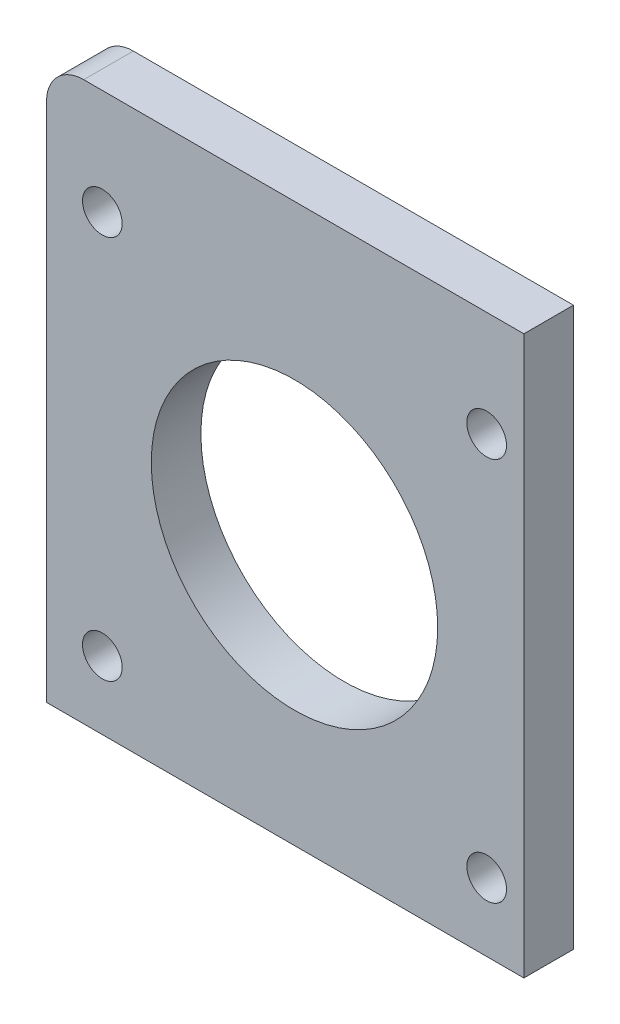
ISO-10303-21;
HEADER;
FILE_DESCRIPTION(('STEP AP214'),'2;1');
FILE_NAME('part.step','',(''),(''),'','','');
FILE_SCHEMA(('AUTOMOTIVE_DESIGN { 1 0 10303 214 1 1 1 1 }'));
ENDSEC;
DATA;
#1=APPLICATION_CONTEXT('core data for automotive mechanical design processes');
#2=APPLICATION_PROTOCOL_DEFINITION('international standard','automotive_design',2000,#1);
#3=PRODUCT_CONTEXT('',#1,'mechanical');
#4=PRODUCT('Part','Part','',(#3));
#5=PRODUCT_RELATED_PRODUCT_CATEGORY('part','',(#4));
#6=PRODUCT_DEFINITION_FORMATION('','',#4);
#7=PRODUCT_DEFINITION_CONTEXT('part definition',#1,'design');
#8=PRODUCT_DEFINITION('design','',#6,#7);
#9=PRODUCT_DEFINITION_SHAPE('','',#8);
#10=(LENGTH_UNIT() NAMED_UNIT(*) SI_UNIT(.MILLI.,.METRE.));
#11=(NAMED_UNIT(*) PLANE_ANGLE_UNIT() SI_UNIT($,.RADIAN.));
#12=(NAMED_UNIT(*) SI_UNIT($,.STERADIAN.) SOLID_ANGLE_UNIT());
#13=UNCERTAINTY_MEASURE_WITH_UNIT(LENGTH_MEASURE(1.E-05),#10,'distance_accuracy_value','');
#14=(GEOMETRIC_REPRESENTATION_CONTEXT(3) GLOBAL_UNCERTAINTY_ASSIGNED_CONTEXT((#13)) GLOBAL_UNIT_ASSIGNED_CONTEXT((#10,
#11,#12)) REPRESENTATION_CONTEXT('',''));
#15=CARTESIAN_POINT('',(0.,0.,0.));
#16=DIRECTION('',(0.,0.,1.));
#17=DIRECTION('',(1.,0.,0.));
#18=AXIS2_PLACEMENT_3D('',#15,#16,#17);
#19=CARTESIAN_POINT('',(27.0710686986759,-58.5949088292678,4.));
#20=DIRECTION('',(0.,0.,1.));
#21=DIRECTION('',(1.,0.,0.));
#22=AXIS2_PLACEMENT_3D('',#19,#20,#21);
#23=PLANE('',#22);
#24=CARTESIAN_POINT('',(44.0710686986754,-79.5949088292686,4.));
#25=DIRECTION('',(0.,0.,1.));
#26=DIRECTION('',(1.,0.,0.));
#27=AXIS2_PLACEMENT_3D('',#24,#25,#26);
#28=CIRCLE('',#27,11.5502037625455);
#29=CARTESIAN_POINT('',(55.6212724612209,-79.5949088292686,4.));
#30=VERTEX_POINT('',#29);
#31=EDGE_CURVE('E166',#30,#30,#28,.T.);
#32=ORIENTED_EDGE('',*,*,#31,.F.);
#33=EDGE_LOOP('',(#32));
#34=FACE_BOUND('',#33,.T.);
#35=CARTESIAN_POINT('',(28.5710686986753,-95.0949088292685,4.));
#36=DIRECTION('',(0.,0.,1.));
#37=DIRECTION('',(1.,0.,0.));
#38=AXIS2_PLACEMENT_3D('',#35,#36,#37);
#39=CIRCLE('',#38,1.59999999999999);
#40=CARTESIAN_POINT('',(30.1710686986753,-95.0949088292685,4.));
#41=VERTEX_POINT('',#40);
#42=EDGE_CURVE('E180',#41,#41,#39,.T.);
#43=ORIENTED_EDGE('',*,*,#42,.F.);
#44=EDGE_LOOP('',(#43));
#45=FACE_BOUND('',#44,.T.);
#46=CARTESIAN_POINT('',(27.0710686986759,-58.5949088292678,4.));
#47=DIRECTION('',(0.,0.,1.));
#48=DIRECTION('',(1.,0.,0.));
#49=AXIS2_PLACEMENT_3D('',#46,#47,#48);
#50=CIRCLE('',#49,3.);
#51=CARTESIAN_POINT('',(27.0710686986759,-55.5949088292678,4.));
#52=VERTEX_POINT('',#51);
#53=CARTESIAN_POINT('',(24.0710686986759,-58.5949088292677,4.));
#54=VERTEX_POINT('',#53);
#55=EDGE_CURVE('E116',#52,#54,#50,.T.);
#56=ORIENTED_EDGE('',*,*,#55,.T.);
#57=DIRECTION('',(0.,-1.,0.));
#58=VECTOR('',#57,1.);
#59=CARTESIAN_POINT('',(24.0710686986757,-100.594908829268,4.));
#60=LINE('',#59,#58);
#61=CARTESIAN_POINT('',(24.0710686986757,-100.594908829268,4.));
#62=VERTEX_POINT('',#61);
#63=EDGE_CURVE('E83',#54,#62,#60,.T.);
#64=ORIENTED_EDGE('',*,*,#63,.T.);
#65=DIRECTION('',(1.,0.,0.));
#66=VECTOR('',#65,1.);
#67=CARTESIAN_POINT('',(24.0710686986757,-100.594908829268,4.));
#68=LINE('',#67,#66);
#69=CARTESIAN_POINT('',(62.5710686986753,-100.594908829268,4.));
#70=VERTEX_POINT('',#69);
#71=EDGE_CURVE('E87',#62,#70,#68,.T.);
#72=ORIENTED_EDGE('',*,*,#71,.T.);
#73=DIRECTION('',(0.,1.,0.));
#74=VECTOR('',#73,1.);
#75=CARTESIAN_POINT('',(62.5710686986753,-100.594908829268,4.));
#76=LINE('',#75,#74);
#77=CARTESIAN_POINT('',(62.5710686986753,-55.5949088292678,4.));
#78=VERTEX_POINT('',#77);
#79=EDGE_CURVE('E91',#70,#78,#76,.T.);
#80=ORIENTED_EDGE('',*,*,#79,.T.);
#81=DIRECTION('',(-1.,0.,0.));
#82=VECTOR('',#81,1.);
#83=CARTESIAN_POINT('',(27.0710686986759,-55.5949088292678,4.));
#84=LINE('',#83,#82);
#85=EDGE_CURVE('E49',#78,#52,#84,.T.);
#86=ORIENTED_EDGE('',*,*,#85,.T.);
#87=EDGE_LOOP('',(#56,#64,#72,#80,#86));
#88=FACE_BOUND('',#87,.T.);
#89=CARTESIAN_POINT('',(28.5710686986753,-64.0949088292685,4.));
#90=DIRECTION('',(0.,0.,1.));
#91=DIRECTION('',(1.,0.,0.));
#92=AXIS2_PLACEMENT_3D('',#89,#90,#91);
#93=CIRCLE('',#92,1.59999999999999);
#94=CARTESIAN_POINT('',(30.1710686986753,-64.0949088292685,4.));
#95=VERTEX_POINT('',#94);
#96=EDGE_CURVE('E111',#95,#95,#93,.T.);
#97=ORIENTED_EDGE('',*,*,#96,.F.);
#98=EDGE_LOOP('',(#97));
#99=FACE_BOUND('',#98,.T.);
#100=CARTESIAN_POINT('',(59.5710686986753,-64.0949088292685,4.));
#101=DIRECTION('',(0.,0.,1.));
#102=DIRECTION('',(1.,0.,0.));
#103=AXIS2_PLACEMENT_3D('',#100,#101,#102);
#104=CIRCLE('',#103,1.59999999999999);
#105=CARTESIAN_POINT('',(61.1710686986753,-64.0949088292685,4.));
#106=VERTEX_POINT('',#105);
#107=EDGE_CURVE('E186',#106,#106,#104,.T.);
#108=ORIENTED_EDGE('',*,*,#107,.F.);
#109=EDGE_LOOP('',(#108));
#110=FACE_BOUND('',#109,.T.);
#111=CARTESIAN_POINT('',(59.5710686986753,-95.0949088292686,4.));
#112=DIRECTION('',(0.,0.,1.));
#113=DIRECTION('',(1.,0.,0.));
#114=AXIS2_PLACEMENT_3D('',#111,#112,#113);
#115=CIRCLE('',#114,1.59999999999999);
#116=CARTESIAN_POINT('',(61.1710686986753,-95.0949088292686,4.));
#117=VERTEX_POINT('',#116);
#118=EDGE_CURVE('E174',#117,#117,#115,.T.);
#119=ORIENTED_EDGE('',*,*,#118,.F.);
#120=EDGE_LOOP('',(#119));
#121=FACE_BOUND('',#120,.T.);
#122=ADVANCED_FACE('F32',(#34,#45,#88,#99,#110,#121),#23,.T.);
#123=CARTESIAN_POINT('',(27.0710686986759,-58.5949088292678,0.));
#124=DIRECTION('',(0.,0.,1.));
#125=DIRECTION('',(1.,0.,0.));
#126=AXIS2_PLACEMENT_3D('',#123,#124,#125);
#127=PLANE('',#126);
#128=CARTESIAN_POINT('',(44.0710686986754,-79.5949088292686,0.));
#129=DIRECTION('',(0.,0.,-1.));
#130=DIRECTION('',(-1.,0.,0.));
#131=AXIS2_PLACEMENT_3D('',#128,#129,#130);
#132=CIRCLE('',#131,11.5502037625455);
#133=CARTESIAN_POINT('',(32.5208649361299,-79.5949088292686,0.));
#134=VERTEX_POINT('',#133);
#135=EDGE_CURVE('E169',#134,#134,#132,.T.);
#136=ORIENTED_EDGE('',*,*,#135,.F.);
#137=EDGE_LOOP('',(#136));
#138=FACE_BOUND('',#137,.T.);
#139=CARTESIAN_POINT('',(27.0710686986759,-58.5949088292678,0.));
#140=DIRECTION('',(0.,0.,1.));
#141=DIRECTION('',(1.,0.,0.));
#142=AXIS2_PLACEMENT_3D('',#139,#140,#141);
#143=CIRCLE('',#142,3.);
#144=CARTESIAN_POINT('',(27.0710686986759,-55.5949088292678,0.));
#145=VERTEX_POINT('',#144);
#146=CARTESIAN_POINT('',(24.0710686986759,-58.5949088292677,0.));
#147=VERTEX_POINT('',#146);
#148=EDGE_CURVE('E107',#145,#147,#143,.T.);
#149=ORIENTED_EDGE('',*,*,#148,.F.);
#150=DIRECTION('',(-1.,0.,0.));
#151=VECTOR('',#150,1.);
#152=CARTESIAN_POINT('',(27.0710686986759,-55.5949088292678,0.));
#153=LINE('',#152,#151);
#154=CARTESIAN_POINT('',(62.5710686986753,-55.5949088292678,0.));
#155=VERTEX_POINT('',#154);
#156=EDGE_CURVE('E75',#155,#145,#153,.T.);
#157=ORIENTED_EDGE('',*,*,#156,.F.);
#158=DIRECTION('',(0.,1.,0.));
#159=VECTOR('',#158,1.);
#160=CARTESIAN_POINT('',(62.5710686986753,-100.594908829268,0.));
#161=LINE('',#160,#159);
#162=CARTESIAN_POINT('',(62.5710686986753,-100.594908829268,0.));
#163=VERTEX_POINT('',#162);
#164=EDGE_CURVE('E69',#163,#155,#161,.T.);
#165=ORIENTED_EDGE('',*,*,#164,.F.);
#166=DIRECTION('',(1.,0.,0.));
#167=VECTOR('',#166,1.);
#168=CARTESIAN_POINT('',(24.0710686986757,-100.594908829268,0.));
#169=LINE('',#168,#167);
#170=CARTESIAN_POINT('',(24.0710686986757,-100.594908829268,0.));
#171=VERTEX_POINT('',#170);
#172=EDGE_CURVE('E98',#171,#163,#169,.T.);
#173=ORIENTED_EDGE('',*,*,#172,.F.);
#174=DIRECTION('',(0.,-1.,0.));
#175=VECTOR('',#174,1.);
#176=CARTESIAN_POINT('',(24.0710686986757,-100.594908829268,0.));
#177=LINE('',#176,#175);
#178=EDGE_CURVE('E110',#147,#171,#177,.T.);
#179=ORIENTED_EDGE('',*,*,#178,.F.);
#180=EDGE_LOOP('',(#149,#157,#165,#173,#179));
#181=FACE_BOUND('',#180,.T.);
#182=CARTESIAN_POINT('',(28.5710686986753,-64.0949088292685,0.));
#183=DIRECTION('',(0.,0.,1.));
#184=DIRECTION('',(1.,0.,0.));
#185=AXIS2_PLACEMENT_3D('',#182,#183,#184);
#186=CIRCLE('',#185,1.59999999999999);
#187=CARTESIAN_POINT('',(30.1710686986753,-64.0949088292685,0.));
#188=VERTEX_POINT('',#187);
#189=EDGE_CURVE('E189',#188,#188,#186,.T.);
#190=ORIENTED_EDGE('',*,*,#189,.T.);
#191=EDGE_LOOP('',(#190));
#192=FACE_BOUND('',#191,.T.);
#193=CARTESIAN_POINT('',(59.5710686986753,-64.0949088292685,0.));
#194=DIRECTION('',(0.,0.,1.));
#195=DIRECTION('',(1.,0.,0.));
#196=AXIS2_PLACEMENT_3D('',#193,#194,#195);
#197=CIRCLE('',#196,1.59999999999999);
#198=CARTESIAN_POINT('',(61.1710686986753,-64.0949088292685,0.));
#199=VERTEX_POINT('',#198);
#200=EDGE_CURVE('E183',#199,#199,#197,.T.);
#201=ORIENTED_EDGE('',*,*,#200,.T.);
#202=EDGE_LOOP('',(#201));
#203=FACE_BOUND('',#202,.T.);
#204=CARTESIAN_POINT('',(28.5710686986753,-95.0949088292685,0.));
#205=DIRECTION('',(0.,0.,1.));
#206=DIRECTION('',(1.,0.,0.));
#207=AXIS2_PLACEMENT_3D('',#204,#205,#206);
#208=CIRCLE('',#207,1.59999999999999);
#209=CARTESIAN_POINT('',(30.1710686986753,-95.0949088292685,0.));
#210=VERTEX_POINT('',#209);
#211=EDGE_CURVE('E177',#210,#210,#208,.T.);
#212=ORIENTED_EDGE('',*,*,#211,.T.);
#213=EDGE_LOOP('',(#212));
#214=FACE_BOUND('',#213,.T.);
#215=CARTESIAN_POINT('',(59.5710686986753,-95.0949088292686,0.));
#216=DIRECTION('',(0.,0.,1.));
#217=DIRECTION('',(1.,0.,0.));
#218=AXIS2_PLACEMENT_3D('',#215,#216,#217);
#219=CIRCLE('',#218,1.59999999999999);
#220=CARTESIAN_POINT('',(61.1710686986753,-95.0949088292686,0.));
#221=VERTEX_POINT('',#220);
#222=EDGE_CURVE('E171',#221,#221,#219,.T.);
#223=ORIENTED_EDGE('',*,*,#222,.T.);
#224=EDGE_LOOP('',(#223));
#225=FACE_BOUND('',#224,.T.);
#226=ADVANCED_FACE('F120',(#138,#181,#192,#203,#214,#225),#127,.F.);
#227=CARTESIAN_POINT('',(27.0710686986759,-58.5949088292678,4.));
#228=DIRECTION('',(0.,0.,-1.));
#229=DIRECTION('',(-1.,0.,0.));
#230=AXIS2_PLACEMENT_3D('',#227,#228,#229);
#231=CYLINDRICAL_SURFACE('',#230,3.);
#232=ORIENTED_EDGE('',*,*,#148,.T.);
#233=DIRECTION('',(0.,0.,-1.));
#234=VECTOR('',#233,1.);
#235=CARTESIAN_POINT('',(24.0710686986759,-58.5949088292677,4.));
#236=LINE('',#235,#234);
#237=EDGE_CURVE('E11',#54,#147,#236,.T.);
#238=ORIENTED_EDGE('',*,*,#237,.F.);
#239=ORIENTED_EDGE('',*,*,#55,.F.);
#240=DIRECTION('',(0.,0.,-1.));
#241=VECTOR('',#240,1.);
#242=CARTESIAN_POINT('',(27.0710686986759,-55.5949088292678,4.));
#243=LINE('',#242,#241);
#244=EDGE_CURVE('E103',#52,#145,#243,.T.);
#245=ORIENTED_EDGE('',*,*,#244,.T.);
#246=EDGE_LOOP('',(#232,#238,#239,#245));
#247=FACE_BOUND('',#246,.T.);
#248=ADVANCED_FACE('F34',(#247),#231,.T.);
#249=CARTESIAN_POINT('',(24.0710686986757,-100.594908829268,4.));
#250=DIRECTION('',(1.,0.,0.));
#251=DIRECTION('',(0.,1.,0.));
#252=AXIS2_PLACEMENT_3D('',#249,#250,#251);
#253=PLANE('',#252);
#254=ORIENTED_EDGE('',*,*,#178,.T.);
#255=DIRECTION('',(0.,0.,-1.));
#256=VECTOR('',#255,1.);
#257=CARTESIAN_POINT('',(24.0710686986757,-100.594908829268,4.));
#258=LINE('',#257,#256);
#259=EDGE_CURVE('E41',#62,#171,#258,.T.);
#260=ORIENTED_EDGE('',*,*,#259,.F.);
#261=ORIENTED_EDGE('',*,*,#63,.F.);
#262=ORIENTED_EDGE('',*,*,#237,.T.);
#263=EDGE_LOOP('',(#254,#260,#261,#262));
#264=FACE_BOUND('',#263,.T.);
#265=ADVANCED_FACE('F249',(#264),#253,.F.);
#266=CARTESIAN_POINT('',(24.0710686986757,-100.594908829268,4.));
#267=DIRECTION('',(0.,1.,0.));
#268=DIRECTION('',(0.,0.,1.));
#269=AXIS2_PLACEMENT_3D('',#266,#267,#268);
#270=PLANE('',#269);
#271=ORIENTED_EDGE('',*,*,#172,.T.);
#272=DIRECTION('',(0.,0.,-1.));
#273=VECTOR('',#272,1.);
#274=CARTESIAN_POINT('',(62.5710686986753,-100.594908829268,4.));
#275=LINE('',#274,#273);
#276=EDGE_CURVE('E95',#70,#163,#275,.T.);
#277=ORIENTED_EDGE('',*,*,#276,.F.);
#278=ORIENTED_EDGE('',*,*,#71,.F.);
#279=ORIENTED_EDGE('',*,*,#259,.T.);
#280=EDGE_LOOP('',(#271,#277,#278,#279));
#281=FACE_BOUND('',#280,.T.);
#282=ADVANCED_FACE('F96',(#281),#270,.F.);
#283=CARTESIAN_POINT('',(62.5710686986753,-100.594908829268,4.));
#284=DIRECTION('',(-1.,0.,0.));
#285=DIRECTION('',(0.,0.,1.));
#286=AXIS2_PLACEMENT_3D('',#283,#284,#285);
#287=PLANE('',#286);
#288=ORIENTED_EDGE('',*,*,#164,.T.);
#289=DIRECTION('',(0.,0.,-1.));
#290=VECTOR('',#289,1.);
#291=CARTESIAN_POINT('',(62.5710686986753,-55.5949088292678,4.));
#292=LINE('',#291,#290);
#293=EDGE_CURVE('E99',#78,#155,#292,.T.);
#294=ORIENTED_EDGE('',*,*,#293,.F.);
#295=ORIENTED_EDGE('',*,*,#79,.F.);
#296=ORIENTED_EDGE('',*,*,#276,.T.);
#297=EDGE_LOOP('',(#288,#294,#295,#296));
#298=FACE_BOUND('',#297,.T.);
#299=ADVANCED_FACE('F101',(#298),#287,.F.);
#300=CARTESIAN_POINT('',(27.0710686986759,-55.5949088292678,4.));
#301=DIRECTION('',(0.,-1.,0.));
#302=DIRECTION('',(0.,0.,-1.));
#303=AXIS2_PLACEMENT_3D('',#300,#301,#302);
#304=PLANE('',#303);
#305=ORIENTED_EDGE('',*,*,#156,.T.);
#306=ORIENTED_EDGE('',*,*,#244,.F.);
#307=ORIENTED_EDGE('',*,*,#85,.F.);
#308=ORIENTED_EDGE('',*,*,#293,.T.);
#309=EDGE_LOOP('',(#305,#306,#307,#308));
#310=FACE_BOUND('',#309,.T.);
#311=ADVANCED_FACE('F125',(#310),#304,.F.);
#312=CARTESIAN_POINT('',(28.5710686986753,-64.0949088292685,4.));
#313=DIRECTION('',(0.,0.,-1.));
#314=DIRECTION('',(-1.,0.,0.));
#315=AXIS2_PLACEMENT_3D('',#312,#313,#314);
#316=CYLINDRICAL_SURFACE('',#315,1.59999999999999);
#317=ORIENTED_EDGE('',*,*,#96,.T.);
#318=EDGE_LOOP('',(#317));
#319=FACE_BOUND('',#318,.T.);
#320=ORIENTED_EDGE('',*,*,#189,.F.);
#321=EDGE_LOOP('',(#320));
#322=FACE_BOUND('',#321,.T.);
#323=ADVANCED_FACE('F127',(#319,#322),#316,.F.);
#324=CARTESIAN_POINT('',(59.5710686986753,-64.0949088292685,4.));
#325=DIRECTION('',(0.,0.,-1.));
#326=DIRECTION('',(-1.,0.,0.));
#327=AXIS2_PLACEMENT_3D('',#324,#325,#326);
#328=CYLINDRICAL_SURFACE('',#327,1.59999999999999);
#329=ORIENTED_EDGE('',*,*,#107,.T.);
#330=EDGE_LOOP('',(#329));
#331=FACE_BOUND('',#330,.T.);
#332=ORIENTED_EDGE('',*,*,#200,.F.);
#333=EDGE_LOOP('',(#332));
#334=FACE_BOUND('',#333,.T.);
#335=ADVANCED_FACE('F133',(#331,#334),#328,.F.);
#336=CARTESIAN_POINT('',(28.5710686986753,-95.0949088292685,4.));
#337=DIRECTION('',(0.,0.,-1.));
#338=DIRECTION('',(-1.,0.,0.));
#339=AXIS2_PLACEMENT_3D('',#336,#337,#338);
#340=CYLINDRICAL_SURFACE('',#339,1.59999999999999);
#341=ORIENTED_EDGE('',*,*,#42,.T.);
#342=EDGE_LOOP('',(#341));
#343=FACE_BOUND('',#342,.T.);
#344=ORIENTED_EDGE('',*,*,#211,.F.);
#345=EDGE_LOOP('',(#344));
#346=FACE_BOUND('',#345,.T.);
#347=ADVANCED_FACE('F150',(#343,#346),#340,.F.);
#348=CARTESIAN_POINT('',(59.5710686986753,-95.0949088292686,4.));
#349=DIRECTION('',(0.,0.,-1.));
#350=DIRECTION('',(-1.,0.,0.));
#351=AXIS2_PLACEMENT_3D('',#348,#349,#350);
#352=CYLINDRICAL_SURFACE('',#351,1.59999999999999);
#353=ORIENTED_EDGE('',*,*,#118,.T.);
#354=EDGE_LOOP('',(#353));
#355=FACE_BOUND('',#354,.T.);
#356=ORIENTED_EDGE('',*,*,#222,.F.);
#357=EDGE_LOOP('',(#356));
#358=FACE_BOUND('',#357,.T.);
#359=ADVANCED_FACE('F154',(#355,#358),#352,.F.);
#360=CARTESIAN_POINT('',(44.0710686986754,-79.5949088292686,5.));
#361=DIRECTION('',(0.,0.,-1.));
#362=DIRECTION('',(-1.,0.,0.));
#363=AXIS2_PLACEMENT_3D('',#360,#361,#362);
#364=CYLINDRICAL_SURFACE('',#363,11.5502037625455);
#365=ORIENTED_EDGE('',*,*,#31,.T.);
#366=EDGE_LOOP('',(#365));
#367=FACE_BOUND('',#366,.T.);
#368=ORIENTED_EDGE('',*,*,#135,.T.);
#369=EDGE_LOOP('',(#368));
#370=FACE_BOUND('',#369,.T.);
#371=ADVANCED_FACE('F158',(#367,#370),#364,.F.);
#372=CLOSED_SHELL('',(#122,#226,#248,#265,#282,#299,#311,#323,#335,#347,#359,#371));
#373=MANIFOLD_SOLID_BREP('B2',#372);
#374=ADVANCED_BREP_SHAPE_REPRESENTATION('',(#18,#373),#14);
#375=SHAPE_DEFINITION_REPRESENTATION(#9,#374);
ENDSEC;
END-ISO-10303-21;
